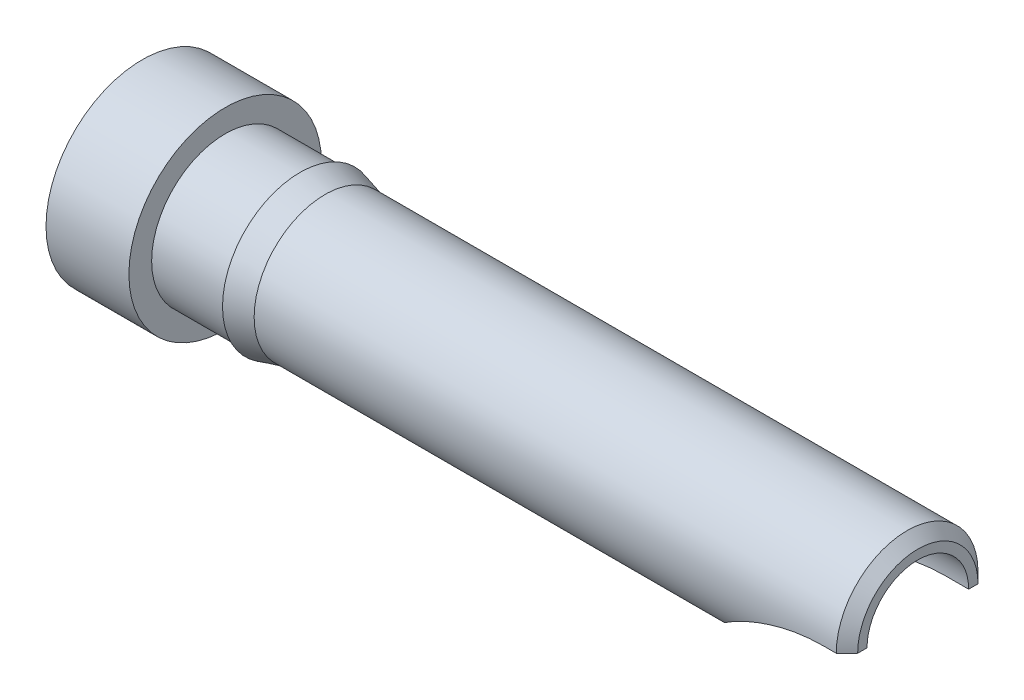
ISO-10303-21;
HEADER;
FILE_DESCRIPTION(('STEP AP214'),'2;1');
FILE_NAME('part.step','',(''),(''),'','','');
FILE_SCHEMA(('AUTOMOTIVE_DESIGN { 1 0 10303 214 1 1 1 1 }'));
ENDSEC;
DATA;
#1=APPLICATION_CONTEXT('core data for automotive mechanical design processes');
#2=APPLICATION_PROTOCOL_DEFINITION('international standard','automotive_design',2000,#1);
#3=PRODUCT_CONTEXT('',#1,'mechanical');
#4=PRODUCT('Part','Part','',(#3));
#5=PRODUCT_RELATED_PRODUCT_CATEGORY('part','',(#4));
#6=PRODUCT_DEFINITION_FORMATION('','',#4);
#7=PRODUCT_DEFINITION_CONTEXT('part definition',#1,'design');
#8=PRODUCT_DEFINITION('design','',#6,#7);
#9=PRODUCT_DEFINITION_SHAPE('','',#8);
#10=(LENGTH_UNIT() NAMED_UNIT(*) SI_UNIT(.MILLI.,.METRE.));
#11=(NAMED_UNIT(*) PLANE_ANGLE_UNIT() SI_UNIT($,.RADIAN.));
#12=(NAMED_UNIT(*) SI_UNIT($,.STERADIAN.) SOLID_ANGLE_UNIT());
#13=UNCERTAINTY_MEASURE_WITH_UNIT(LENGTH_MEASURE(1.E-05),#10,'distance_accuracy_value','');
#14=(GEOMETRIC_REPRESENTATION_CONTEXT(3) GLOBAL_UNCERTAINTY_ASSIGNED_CONTEXT((#13)) GLOBAL_UNIT_ASSIGNED_CONTEXT((#10,
#11,#12)) REPRESENTATION_CONTEXT('',''));
#15=CARTESIAN_POINT('',(0.,0.,0.));
#16=DIRECTION('',(0.,0.,1.));
#17=DIRECTION('',(1.,0.,0.));
#18=AXIS2_PLACEMENT_3D('',#15,#16,#17);
#19=CARTESIAN_POINT('',(0.,0.,0.));
#20=DIRECTION('',(-1.,0.,0.));
#21=DIRECTION('',(0.,0.,1.));
#22=AXIS2_PLACEMENT_3D('',#19,#20,#21);
#23=CYLINDRICAL_SURFACE('',#22,0.673099999999982);
#24=CARTESIAN_POINT('',(1.73558522628081,0.,0.));
#25=DIRECTION('',(-1.,0.,0.));
#26=DIRECTION('',(0.,0.,1.));
#27=AXIS2_PLACEMENT_3D('',#24,#25,#26);
#28=CIRCLE('',#27,0.673099999999982);
#29=CARTESIAN_POINT('',(1.73558522628081,0.,0.673099999999982));
#30=VERTEX_POINT('',#29);
#31=EDGE_CURVE('E134',#30,#30,#28,.T.);
#32=ORIENTED_EDGE('',*,*,#31,.F.);
#33=EDGE_LOOP('',(#32));
#34=FACE_BOUND('',#33,.T.);
#35=DIRECTION('',(-1.,0.,0.));
#36=VECTOR('',#35,1.);
#37=CARTESIAN_POINT('',(7.366,0.,0.6731));
#38=LINE('',#37,#36);
#39=CARTESIAN_POINT('',(7.26439999999999,0.,0.6731));
#40=VERTEX_POINT('',#39);
#41=CARTESIAN_POINT('',(7.14627206901013,0.,0.6731));
#42=VERTEX_POINT('',#41);
#43=EDGE_CURVE('E96',#40,#42,#38,.T.);
#44=ORIENTED_EDGE('',*,*,#43,.F.);
#45=CARTESIAN_POINT('',(7.2644,0.,0.));
#46=DIRECTION('',(-1.,0.,0.));
#47=DIRECTION('',(0.,0.,1.));
#48=AXIS2_PLACEMENT_3D('',#45,#46,#47);
#49=CIRCLE('',#48,0.673099999999982);
#50=CARTESIAN_POINT('',(7.26439999999999,0.,-0.6731));
#51=VERTEX_POINT('',#50);
#52=EDGE_CURVE('E100',#40,#51,#49,.T.);
#53=ORIENTED_EDGE('',*,*,#52,.T.);
#54=DIRECTION('',(-1.,0.,0.));
#55=VECTOR('',#54,1.);
#56=CARTESIAN_POINT('',(7.366,0.,-0.6731));
#57=LINE('',#56,#55);
#58=CARTESIAN_POINT('',(7.14627206901013,0.,-0.6731));
#59=VERTEX_POINT('',#58);
#60=EDGE_CURVE('E93',#51,#59,#57,.T.);
#61=ORIENTED_EDGE('',*,*,#60,.T.);
#62=CARTESIAN_POINT('',(7.14627206901013,0.,0.673099999999982));
#63=CARTESIAN_POINT('',(7.10153435985772,4.46470911448281E-06,0.673066996941822));
#64=CARTESIAN_POINT('',(7.05679798581207,-0.00187603562394162,0.673099064908512));
#65=CARTESIAN_POINT('',(6.96761605547631,-0.00937573830040865,0.67305391674016));
#66=CARTESIAN_POINT('',(6.92317066463661,-0.0149969078173788,0.672976643079558));
#67=CARTESIAN_POINT('',(6.83458204846246,-0.0300016269015608,0.672471063789258));
#68=CARTESIAN_POINT('',(6.7904434489281,-0.0394125410488758,0.67204018084596));
#69=CARTESIAN_POINT('',(6.70315420933484,-0.0619158750425256,0.670340910004236));
#70=CARTESIAN_POINT('',(6.66000318996158,-0.075006854870609,0.669072849434154));
#71=CARTESIAN_POINT('',(6.55388062167852,-0.112164126167215,0.664074429507753));
#72=CARTESIAN_POINT('',(6.49170662000296,-0.138452468771553,0.659434069353343));
#73=CARTESIAN_POINT('',(6.37191822498993,-0.198252354734136,0.643978500323973));
#74=CARTESIAN_POINT('',(6.31428673040485,-0.23173484508686,0.633187847450312));
#75=CARTESIAN_POINT('',(6.22258929627688,-0.292734721011279,0.606709296231323));
#76=CARTESIAN_POINT('',(6.18681894934434,-0.318808508889903,0.593634968973889));
#77=CARTESIAN_POINT('',(6.11917052511126,-0.372376322965744,0.561578420711508));
#78=CARTESIAN_POINT('',(6.08728729240408,-0.399868397657579,0.542604146013661));
#79=CARTESIAN_POINT('',(6.03409132474372,-0.44922187221879,0.502071484334222));
#80=CARTESIAN_POINT('',(6.01192587564313,-0.471146591222787,0.481717307907256));
#81=CARTESIAN_POINT('',(5.97128248307482,-0.513507841378227,0.436275116431738));
#82=CARTESIAN_POINT('',(5.95280350946342,-0.533944787254325,0.41118842765306));
#83=CARTESIAN_POINT('',(5.91982554956495,-0.572040917007239,0.356307564587144));
#84=CARTESIAN_POINT('',(5.90535496183745,-0.589679920238312,0.326482044476282));
#85=CARTESIAN_POINT('',(5.88080325132035,-0.62059703023007,0.262995813801498));
#86=CARTESIAN_POINT('',(5.87072012677458,-0.633877125038099,0.229336861083235));
#87=CARTESIAN_POINT('',(5.85595423624755,-0.653704306568095,0.163610127165051));
#88=CARTESIAN_POINT('',(5.85076652044479,-0.660870623123024,0.131840701116766));
#89=CARTESIAN_POINT('',(5.84381783450025,-0.670528273084018,0.0672357167353866));
#90=CARTESIAN_POINT('',(5.84205568323101,-0.67302121784828,0.0344005298459773));
#91=CARTESIAN_POINT('',(5.8419498312962,-0.673171000090173,-0.0295028732713886));
#92=CARTESIAN_POINT('',(5.84342654509382,-0.671081898503721,-0.0605706881083138));
#93=CARTESIAN_POINT('',(5.84944189038786,-0.662704482073932,-0.121825395034786));
#94=CARTESIAN_POINT('',(5.85397997274739,-0.656416920336778,-0.152012444099867));
#95=CARTESIAN_POINT('',(5.86611211447296,-0.640026511809589,-0.210601498801503));
#96=CARTESIAN_POINT('',(5.87369883341493,-0.629932832856258,-0.23900760397343));
#97=CARTESIAN_POINT('',(5.89190305399311,-0.606511203684345,-0.293402561812445));
#98=CARTESIAN_POINT('',(5.90252064366179,-0.593183159524428,-0.319391344238661));
#99=CARTESIAN_POINT('',(5.92716311816597,-0.563475343359758,-0.369373318030377));
#100=CARTESIAN_POINT('',(5.94130352602772,-0.54699777269607,-0.393251033632782));
#101=CARTESIAN_POINT('',(5.97254920219838,-0.512283982215925,-0.437517649837415));
#102=CARTESIAN_POINT('',(5.98965574717114,-0.494047006634338,-0.457905040618374));
#103=CARTESIAN_POINT('',(6.03305703349425,-0.450137924421539,-0.501706887645628));
#104=CARTESIAN_POINT('',(6.06046647929303,-0.424108231610728,-0.523660905420559));
#105=CARTESIAN_POINT('',(6.11934854163021,-0.37235003239704,-0.561654113279127));
#106=CARTESIAN_POINT('',(6.15082789046543,-0.346622103842159,-0.577683329325189));
#107=CARTESIAN_POINT('',(6.23032271379205,-0.286794572141143,-0.610243425678054));
#108=CARTESIAN_POINT('',(6.27989964764994,-0.253485711935731,-0.624387179060117));
#109=CARTESIAN_POINT('',(6.38361083729961,-0.192134868798973,-0.645918596445292));
#110=CARTESIAN_POINT('',(6.43775691585452,-0.164107196213927,-0.65328810790118));
#111=CARTESIAN_POINT('',(6.53229732354482,-0.121860077027676,-0.662211767996978));
#112=CARTESIAN_POINT('',(6.57189158985068,-0.106029222479572,-0.66485108233521));
#113=CARTESIAN_POINT('',(6.65229729696788,-0.0775550362771958,-0.66877227564151));
#114=CARTESIAN_POINT('',(6.69310929581059,-0.0649131918895133,-0.670053522132692));
#115=CARTESIAN_POINT('',(6.77558144884244,-0.0429432358586147,-0.671818838287846));
#116=CARTESIAN_POINT('',(6.81724068495996,-0.0336117203416867,-0.672303728685368));
#117=CARTESIAN_POINT('',(6.90115412649108,-0.0183104391839074,-0.672894594671953));
#118=CARTESIAN_POINT('',(6.94340799060913,-0.012338819765698,-0.673000779379779));
#119=CARTESIAN_POINT('',(7.01250550612327,-0.00537525277684272,-0.6730837168539));
#120=CARTESIAN_POINT('',(7.03925004323426,-0.00335777151107894,-0.673093874895806));
#121=CARTESIAN_POINT('',(7.09275291792986,-0.000671365620898936,-0.673100097370282));
#122=CARTESIAN_POINT('',(7.11951111996911,2.58752109543171E-07,-0.673096190061669));
#123=CARTESIAN_POINT('',(7.14627206901013,0.,-0.673099999999982));
#124=B_SPLINE_CURVE_WITH_KNOTS('',3,(#62,#63,#64,#65,#66,#67,#68,#69,#70,#71,#72,#73,#74,#75,
#76,#77,#78,#79,#80,#81,#82,#83,#84,#85,#86,#87,#88,#89,#90,#91,#92,#93,#94,#95,#96,#97,#98,#99,
#100,#101,#102,#103,#104,#105,#106,#107,#108,#109,#110,#111,#112,#113,#114,#115,#116,#117,#118,
#119,#120,#121,#122,#123),.UNSPECIFIED.,.F.,.F.,(4,2,2,2,2,2,2,2,2,2,2,2,2,2,2,2,2,2,2,2,2,2,2,
2,2,2,2,2,2,2,4),(0.,0.134171278306699,0.268413171516379,0.403642280975282,0.538818548450334,
0.741116789579524,0.942612925543703,1.08063370876182,1.21846939890387,1.329720832662,
1.44094113479115,1.55293035026713,1.66486841756249,1.7632947132309,1.8616870656958,
1.95476234070997,2.04782092466619,2.14065677455989,2.2334953211706,2.32991102311003,
2.42636832709929,2.55677763328148,2.68740548625478,2.8705289698726,3.05414174056488,
3.1821608506811,3.31023955546375,3.43818617786956,3.56606213805326,3.64649259518548,
3.72676154907161),.UNSPECIFIED.);
#125=EDGE_CURVE('E80',#42,#59,#124,.T.);
#126=ORIENTED_EDGE('',*,*,#125,.F.);
#127=EDGE_LOOP('',(#44,#53,#61,#126));
#128=FACE_BOUND('',#127,.T.);
#129=ADVANCED_FACE('F34',(#34,#128),#23,.T.);
#130=CARTESIAN_POINT('',(7.366,0.,0.));
#131=DIRECTION('',(-1.,0.,0.));
#132=DIRECTION('',(0.,0.,1.));
#133=AXIS2_PLACEMENT_3D('',#130,#131,#132);
#134=PLANE('',#133);
#135=DIRECTION('',(0.,0.,-1.));
#136=VECTOR('',#135,1.);
#137=CARTESIAN_POINT('',(7.366,0.,0.6731));
#138=LINE('',#137,#136);
#139=CARTESIAN_POINT('',(7.366,0.,-0.4826));
#140=VERTEX_POINT('',#139);
#141=CARTESIAN_POINT('',(7.366,0.,-0.571499999999974));
#142=VERTEX_POINT('',#141);
#143=EDGE_CURVE('E104',#140,#142,#138,.T.);
#144=ORIENTED_EDGE('',*,*,#143,.T.);
#145=CARTESIAN_POINT('',(7.366,0.,0.));
#146=DIRECTION('',(-1.,0.,0.));
#147=DIRECTION('',(0.,0.,1.));
#148=AXIS2_PLACEMENT_3D('',#145,#146,#147);
#149=CIRCLE('',#148,0.571499999999975);
#150=CARTESIAN_POINT('',(7.366,0.,0.571499999999974));
#151=VERTEX_POINT('',#150);
#152=EDGE_CURVE('E152',#151,#142,#149,.T.);
#153=ORIENTED_EDGE('',*,*,#152,.F.);
#154=CARTESIAN_POINT('',(7.366,0.,0.4826));
#155=VERTEX_POINT('',#154);
#156=EDGE_CURVE('E107',#151,#155,#138,.T.);
#157=ORIENTED_EDGE('',*,*,#156,.T.);
#158=CARTESIAN_POINT('',(7.366,0.,0.));
#159=DIRECTION('',(1.,0.,0.));
#160=DIRECTION('',(0.,0.,-1.));
#161=AXIS2_PLACEMENT_3D('',#158,#159,#160);
#162=CIRCLE('',#161,0.4826);
#163=EDGE_CURVE('E88',#140,#155,#162,.T.);
#164=ORIENTED_EDGE('',*,*,#163,.F.);
#165=EDGE_LOOP('',(#144,#153,#157,#164));
#166=FACE_BOUND('',#165,.T.);
#167=ADVANCED_FACE('F165',(#166),#134,.F.);
#168=CARTESIAN_POINT('',(7.366,0.,0.));
#169=DIRECTION('',(-1.,0.,0.));
#170=DIRECTION('',(0.,0.,1.));
#171=AXIS2_PLACEMENT_3D('',#168,#169,#170);
#172=CONICAL_SURFACE('',#171,0.571499999999975,0.785398163397516);
#173=DIRECTION('',(-0.7071067811865,0.,0.707106781186595));
#174=VECTOR('',#173,1.);
#175=CARTESIAN_POINT('',(7.93749999999989,0.,0.));
#176=LINE('',#175,#174);
#177=EDGE_CURVE('E89',#151,#40,#176,.T.);
#178=ORIENTED_EDGE('',*,*,#177,.F.);
#179=ORIENTED_EDGE('',*,*,#152,.T.);
#180=DIRECTION('',(0.7071067811865,0.,0.707106781186595));
#181=VECTOR('',#180,1.);
#182=CARTESIAN_POINT('',(7.93749999999989,0.,0.));
#183=LINE('',#182,#181);
#184=EDGE_CURVE('E108',#51,#142,#183,.T.);
#185=ORIENTED_EDGE('',*,*,#184,.F.);
#186=ORIENTED_EDGE('',*,*,#52,.F.);
#187=EDGE_LOOP('',(#178,#179,#185,#186));
#188=FACE_BOUND('',#187,.T.);
#189=ADVANCED_FACE('F169',(#188),#172,.T.);
#190=CARTESIAN_POINT('',(7.366,0.,0.));
#191=DIRECTION('',(1.,0.,0.));
#192=DIRECTION('',(0.,0.,-1.));
#193=AXIS2_PLACEMENT_3D('',#190,#191,#192);
#194=CYLINDRICAL_SURFACE('',#193,0.4826);
#195=CARTESIAN_POINT('',(5.08,0.,0.));
#196=DIRECTION('',(1.,0.,0.));
#197=DIRECTION('',(0.,0.,-1.));
#198=AXIS2_PLACEMENT_3D('',#195,#196,#197);
#199=CIRCLE('',#198,0.4826);
#200=CARTESIAN_POINT('',(5.08,0.,-0.4826));
#201=VERTEX_POINT('',#200);
#202=EDGE_CURVE('E155',#201,#201,#199,.T.);
#203=ORIENTED_EDGE('',*,*,#202,.F.);
#204=EDGE_LOOP('',(#203));
#205=FACE_BOUND('',#204,.T.);
#206=DIRECTION('',(1.,0.,0.));
#207=VECTOR('',#206,1.);
#208=CARTESIAN_POINT('',(7.366,0.,-0.4826));
#209=LINE('',#208,#207);
#210=CARTESIAN_POINT('',(7.14627206901013,0.,-0.4826));
#211=VERTEX_POINT('',#210);
#212=EDGE_CURVE('E11',#140,#211,#209,.F.);
#213=ORIENTED_EDGE('',*,*,#212,.F.);
#214=ORIENTED_EDGE('',*,*,#163,.T.);
#215=DIRECTION('',(1.,0.,0.));
#216=VECTOR('',#215,1.);
#217=CARTESIAN_POINT('',(7.366,0.,0.4826));
#218=LINE('',#217,#216);
#219=CARTESIAN_POINT('',(7.14627206901013,0.,0.4826));
#220=VERTEX_POINT('',#219);
#221=EDGE_CURVE('E132',#220,#155,#218,.T.);
#222=ORIENTED_EDGE('',*,*,#221,.F.);
#223=CARTESIAN_POINT('',(7.14627206901013,0.,-0.4826));
#224=CARTESIAN_POINT('',(7.10559636320607,3.11156468287568E-06,-0.482568413246393));
#225=CARTESIAN_POINT('',(7.0649213791167,-0.00155082774002899,-0.482599067192687));
#226=CARTESIAN_POINT('',(6.98378324906303,-0.00775179817454373,-0.482556107346207));
#227=CARTESIAN_POINT('',(6.94332024582744,-0.0124006962494511,-0.482482430588676));
#228=CARTESIAN_POINT('',(6.86253133758448,-0.0248220024737073,-0.48199954437275));
#229=CARTESIAN_POINT('',(6.82220937681218,-0.032620086309062,-0.481587547296954));
#230=CARTESIAN_POINT('',(6.74231726910404,-0.0512833724740965,-0.47995873339339));
#231=CARTESIAN_POINT('',(6.70274681136048,-0.0621472759948752,-0.478742257083983));
#232=CARTESIAN_POINT('',(6.60885503590182,-0.0918476218901493,-0.474108354456359));
#233=CARTESIAN_POINT('',(6.55501360149026,-0.112132698438881,-0.470001662878306));
#234=CARTESIAN_POINT('',(6.45046429423993,-0.158076039761597,-0.456604116046307));
#235=CARTESIAN_POINT('',(6.39974542685928,-0.183713868138482,-0.44733276074436));
#236=CARTESIAN_POINT('',(6.32008663489397,-0.229300894596023,-0.425107802627955));
#237=CARTESIAN_POINT('',(6.28978751853437,-0.248055743012043,-0.414615694455189));
#238=CARTESIAN_POINT('',(6.23185028468074,-0.286551515944586,-0.389004937024612));
#239=CARTESIAN_POINT('',(6.20420869247025,-0.306291100146206,-0.37389244011767));
#240=CARTESIAN_POINT('',(6.15919457304848,-0.340475994326644,-0.342592044045321));
#241=CARTESIAN_POINT('',(6.14100211962167,-0.35498617004071,-0.327664018595269));
#242=CARTESIAN_POINT('',(6.10720110260123,-0.383051065015137,-0.294358557105889));
#243=CARTESIAN_POINT('',(6.09158919557516,-0.396607007317103,-0.275985651323811));
#244=CARTESIAN_POINT('',(6.06622152501292,-0.419367436755214,-0.239588818049615));
#245=CARTESIAN_POINT('',(6.0559166747234,-0.428909430951289,-0.222161015014629));
#246=CARTESIAN_POINT('',(6.0377297200039,-0.446106971668984,-0.185217599844196));
#247=CARTESIAN_POINT('',(6.02984672882881,-0.4537632084421,-0.165702755399516));
#248=CARTESIAN_POINT('',(6.01675682036067,-0.466656298694377,-0.124881111826358));
#249=CARTESIAN_POINT('',(6.01156689420551,-0.471877770257115,-0.103563898859299));
#250=CARTESIAN_POINT('',(6.00415808634382,-0.479376904107875,-0.0599157188757849));
#251=CARTESIAN_POINT('',(6.00193782665225,-0.481655931732079,-0.0375852270181031));
#252=CARTESIAN_POINT('',(6.00063490546902,-0.48299111268796,0.00483130566893383));
#253=CARTESIAN_POINT('',(6.00123870872289,-0.482369341235943,0.0248987284731675));
#254=CARTESIAN_POINT('',(6.00485780591351,-0.478674182618346,0.0645796788795449));
#255=CARTESIAN_POINT('',(6.00787253974846,-0.475601364874581,0.0841933108165069));
#256=CARTESIAN_POINT('',(6.01612138887356,-0.467313275479802,0.122018161864448));
#257=CARTESIAN_POINT('',(6.02130770469646,-0.462144217784248,0.140250148162507));
#258=CARTESIAN_POINT('',(6.03372923470304,-0.449998432792089,0.175355341604345));
#259=CARTESIAN_POINT('',(6.04096479287101,-0.443021402027228,0.192228320014836));
#260=CARTESIAN_POINT('',(6.05796056316649,-0.42701434974986,0.225684386610983));
#261=CARTESIAN_POINT('',(6.06788052088783,-0.417861964298873,0.242127070658866));
#262=CARTESIAN_POINT('',(6.08959903799094,-0.398411486176996,0.272954180100983));
#263=CARTESIAN_POINT('',(6.10139870909161,-0.388112716592832,0.287337377834142));
#264=CARTESIAN_POINT('',(6.13332278426048,-0.361165236677973,0.321166086601313));
#265=CARTESIAN_POINT('',(6.1545325719473,-0.344057277009357,0.339224807623148));
#266=CARTESIAN_POINT('',(6.19981858965855,-0.309586319605807,0.370959040401207));
#267=CARTESIAN_POINT('',(6.22390114666855,-0.292222835617257,0.384624622897615));
#268=CARTESIAN_POINT('',(6.2875462205532,-0.249135294908827,0.41454096737419));
#269=CARTESIAN_POINT('',(6.32855299505503,-0.223852867993193,0.428328745738787));
#270=CARTESIAN_POINT('',(6.41391398883157,-0.176579079086453,0.449888369759487));
#271=CARTESIAN_POINT('',(6.45827750779956,-0.154597404157936,0.457642776776627));
#272=CARTESIAN_POINT('',(6.54032848970227,-0.118623438166407,0.468088976302742));
#273=CARTESIAN_POINT('',(6.57762104828912,-0.103909625792596,0.471474985934354));
#274=CARTESIAN_POINT('',(6.65332776888436,-0.0772892322379143,0.476564050516));
#275=CARTESIAN_POINT('',(6.69174266021337,-0.0653845242303601,0.478265984888705));
#276=CARTESIAN_POINT('',(6.7693705272144,-0.0445005128298764,0.48065857974409));
#277=CARTESIAN_POINT('',(6.80858323852675,-0.0355202566601652,0.481349569845846));
#278=CARTESIAN_POINT('',(6.88755822956028,-0.0205413366218222,0.482220945376052));
#279=CARTESIAN_POINT('',(6.92732019919921,-0.0145410558705825,0.48240160794931));
#280=CARTESIAN_POINT('',(6.99699975086234,-0.00669618717794625,0.482565344431033));
#281=CARTESIAN_POINT('',(7.0268437380328,-0.00418223494122,0.482587039596651));
#282=CARTESIAN_POINT('',(7.08654859337287,-0.000835973527503762,0.48259992095909));
#283=CARTESIAN_POINT('',(7.11640921932852,6.57627545181277E-07,0.482591185725966));
#284=CARTESIAN_POINT('',(7.14627206901013,0.,0.4826));
#285=B_SPLINE_CURVE_WITH_KNOTS('',3,(#223,#224,#225,#226,#227,#228,#229,#230,#231,#232,#233,
#234,#235,#236,#237,#238,#239,#240,#241,#242,#243,#244,#245,#246,#247,#248,#249,#250,#251,#252,
#253,#254,#255,#256,#257,#258,#259,#260,#261,#262,#263,#264,#265,#266,#267,#268,#269,#270,#271,
#272,#273,#274,#275,#276,#277,#278,#279,#280,#281,#282,#283,#284),.UNSPECIFIED.,.F.,.F.,(4,2,2,
2,2,2,2,2,2,2,2,2,2,2,2,2,2,2,2,2,2,2,2,2,2,2,2,2,2,2,4),(0.,0.121996179691924,
0.244066016840592,0.367151871365472,0.490185659673897,0.662786855266494,0.834740743821611,
0.94588792646613,1.05688774921493,1.13954527944655,1.22209486213678,1.28897037722341,
1.35582137709191,1.42308917762401,1.49032575370084,1.55028631393479,1.61023294831574,
1.66892420540318,1.72762532020564,1.7912006270573,1.85481367481123,1.95232563005499,
2.05005645461195,2.19953914932629,2.34945231475233,2.4699945032072,2.59061684615185,
2.71119985132686,2.83171735859529,2.92152148958258,3.01109392199202),.UNSPECIFIED.);
#286=EDGE_CURVE('E42',#211,#220,#285,.T.);
#287=ORIENTED_EDGE('',*,*,#286,.F.);
#288=EDGE_LOOP('',(#213,#214,#222,#287));
#289=FACE_BOUND('',#288,.T.);
#290=ADVANCED_FACE('F123',(#205,#289),#194,.F.);
#291=CARTESIAN_POINT('',(1.73558522628081,0.,0.));
#292=DIRECTION('',(-1.,0.,0.));
#293=DIRECTION('',(0.,0.,1.));
#294=AXIS2_PLACEMENT_3D('',#291,#292,#293);
#295=CONICAL_SURFACE('',#294,0.673099999999982,0.261799387799027);
#296=CARTESIAN_POINT('',(1.4986,0.,0.));
#297=DIRECTION('',(-1.,0.,0.));
#298=DIRECTION('',(0.,0.,1.));
#299=AXIS2_PLACEMENT_3D('',#296,#297,#298);
#300=CIRCLE('',#299,0.7366);
#301=CARTESIAN_POINT('',(1.4986,0.,0.7366));
#302=VERTEX_POINT('',#301);
#303=EDGE_CURVE('E137',#302,#302,#300,.T.);
#304=ORIENTED_EDGE('',*,*,#303,.F.);
#305=EDGE_LOOP('',(#304));
#306=FACE_BOUND('',#305,.T.);
#307=ORIENTED_EDGE('',*,*,#31,.T.);
#308=EDGE_LOOP('',(#307));
#309=FACE_BOUND('',#308,.T.);
#310=ADVANCED_FACE('F176',(#306,#309),#295,.T.);
#311=CARTESIAN_POINT('',(1.4986,0.6985,0.));
#312=DIRECTION('',(1.,0.,0.));
#313=DIRECTION('',(0.,0.,-1.));
#314=AXIS2_PLACEMENT_3D('',#311,#312,#313);
#315=PLANE('',#314);
#316=CARTESIAN_POINT('',(1.4986,0.,0.));
#317=DIRECTION('',(-1.,0.,0.));
#318=DIRECTION('',(0.,0.,1.));
#319=AXIS2_PLACEMENT_3D('',#316,#317,#318);
#320=CIRCLE('',#319,0.6985);
#321=CARTESIAN_POINT('',(1.4986,0.,0.6985));
#322=VERTEX_POINT('',#321);
#323=EDGE_CURVE('E140',#322,#322,#320,.T.);
#324=ORIENTED_EDGE('',*,*,#323,.F.);
#325=EDGE_LOOP('',(#324));
#326=FACE_BOUND('',#325,.T.);
#327=ORIENTED_EDGE('',*,*,#303,.T.);
#328=EDGE_LOOP('',(#327));
#329=FACE_BOUND('',#328,.T.);
#330=ADVANCED_FACE('F186',(#326,#329),#315,.F.);
#331=CARTESIAN_POINT('',(0.,0.,0.));
#332=DIRECTION('',(-1.,0.,0.));
#333=DIRECTION('',(0.,0.,1.));
#334=AXIS2_PLACEMENT_3D('',#331,#332,#333);
#335=CYLINDRICAL_SURFACE('',#334,0.6985);
#336=CARTESIAN_POINT('',(0.7874,0.,0.));
#337=DIRECTION('',(-1.,0.,0.));
#338=DIRECTION('',(0.,0.,1.));
#339=AXIS2_PLACEMENT_3D('',#336,#337,#338);
#340=CIRCLE('',#339,0.6985);
#341=CARTESIAN_POINT('',(0.7874,0.,0.6985));
#342=VERTEX_POINT('',#341);
#343=EDGE_CURVE('E143',#342,#342,#340,.T.);
#344=ORIENTED_EDGE('',*,*,#343,.F.);
#345=EDGE_LOOP('',(#344));
#346=FACE_BOUND('',#345,.T.);
#347=ORIENTED_EDGE('',*,*,#323,.T.);
#348=EDGE_LOOP('',(#347));
#349=FACE_BOUND('',#348,.T.);
#350=ADVANCED_FACE('F191',(#346,#349),#335,.T.);
#351=CARTESIAN_POINT('',(0.7874,0.9144,0.));
#352=DIRECTION('',(-1.,0.,0.));
#353=DIRECTION('',(0.,0.,1.));
#354=AXIS2_PLACEMENT_3D('',#351,#352,#353);
#355=PLANE('',#354);
#356=CARTESIAN_POINT('',(0.7874,0.,0.));
#357=DIRECTION('',(-1.,0.,0.));
#358=DIRECTION('',(0.,0.,1.));
#359=AXIS2_PLACEMENT_3D('',#356,#357,#358);
#360=CIRCLE('',#359,0.9144);
#361=CARTESIAN_POINT('',(0.7874,0.,0.9144));
#362=VERTEX_POINT('',#361);
#363=EDGE_CURVE('E146',#362,#362,#360,.T.);
#364=ORIENTED_EDGE('',*,*,#363,.F.);
#365=EDGE_LOOP('',(#364));
#366=FACE_BOUND('',#365,.T.);
#367=ORIENTED_EDGE('',*,*,#343,.T.);
#368=EDGE_LOOP('',(#367));
#369=FACE_BOUND('',#368,.T.);
#370=ADVANCED_FACE('F198',(#366,#369),#355,.F.);
#371=CARTESIAN_POINT('',(0.,0.,0.));
#372=DIRECTION('',(-1.,0.,0.));
#373=DIRECTION('',(0.,0.,1.));
#374=AXIS2_PLACEMENT_3D('',#371,#372,#373);
#375=CYLINDRICAL_SURFACE('',#374,0.914400000000005);
#376=CARTESIAN_POINT('',(0.,0.,0.));
#377=DIRECTION('',(-1.,0.,0.));
#378=DIRECTION('',(0.,0.,1.));
#379=AXIS2_PLACEMENT_3D('',#376,#377,#378);
#380=CIRCLE('',#379,0.91440000000001);
#381=CARTESIAN_POINT('',(0.,0.,0.91440000000001));
#382=VERTEX_POINT('',#381);
#383=EDGE_CURVE('E149',#382,#382,#380,.T.);
#384=ORIENTED_EDGE('',*,*,#383,.F.);
#385=EDGE_LOOP('',(#384));
#386=FACE_BOUND('',#385,.T.);
#387=ORIENTED_EDGE('',*,*,#363,.T.);
#388=EDGE_LOOP('',(#387));
#389=FACE_BOUND('',#388,.T.);
#390=ADVANCED_FACE('F202',(#386,#389),#375,.T.);
#391=CARTESIAN_POINT('',(0.,0.,0.));
#392=DIRECTION('',(1.,0.,0.));
#393=DIRECTION('',(0.,0.,-1.));
#394=AXIS2_PLACEMENT_3D('',#391,#392,#393);
#395=PLANE('',#394);
#396=ORIENTED_EDGE('',*,*,#383,.T.);
#397=EDGE_LOOP('',(#396));
#398=FACE_BOUND('',#397,.T.);
#399=ADVANCED_FACE('F206',(#398),#395,.F.);
#400=CARTESIAN_POINT('',(5.08,0.,0.));
#401=DIRECTION('',(1.,0.,0.));
#402=DIRECTION('',(0.,0.,-1.));
#403=AXIS2_PLACEMENT_3D('',#400,#401,#402);
#404=CONICAL_SURFACE('',#403,0.4826,1.02974425867666);
#405=CARTESIAN_POINT('',(4.7900246652573,0.,0.));
#406=VERTEX_POINT('',#405);
#407=VERTEX_LOOP('',#406);
#408=FACE_BOUND('',#407,.T.);
#409=ORIENTED_EDGE('',*,*,#202,.T.);
#410=EDGE_LOOP('',(#409));
#411=FACE_BOUND('',#410,.T.);
#412=ADVANCED_FACE('F122',(#408,#411),#404,.F.);
#413=CARTESIAN_POINT('',(7.14627206901013,-1.6002,0.6731));
#414=DIRECTION('',(0.,0.,-1.));
#415=DIRECTION('',(-1.,0.,0.));
#416=AXIS2_PLACEMENT_3D('',#413,#414,#415);
#417=CYLINDRICAL_SURFACE('',#416,1.6002);
#418=ORIENTED_EDGE('',*,*,#125,.T.);
#419=DIRECTION('',(0.,0.,-1.));
#420=VECTOR('',#419,1.);
#421=CARTESIAN_POINT('',(7.14627206901013,0.,0.6731));
#422=LINE('',#421,#420);
#423=EDGE_CURVE('E83',#211,#59,#422,.T.);
#424=ORIENTED_EDGE('',*,*,#423,.F.);
#425=ORIENTED_EDGE('',*,*,#286,.T.);
#426=EDGE_CURVE('E49',#42,#220,#422,.T.);
#427=ORIENTED_EDGE('',*,*,#426,.F.);
#428=EDGE_LOOP('',(#418,#424,#425,#427));
#429=FACE_BOUND('',#428,.T.);
#430=ADVANCED_FACE('F82',(#429),#417,.F.);
#431=CARTESIAN_POINT('',(7.366,0.,0.6731));
#432=DIRECTION('',(0.,-1.,0.));
#433=DIRECTION('',(0.,0.,-1.));
#434=AXIS2_PLACEMENT_3D('',#431,#432,#433);
#435=PLANE('',#434);
#436=ORIENTED_EDGE('',*,*,#177,.T.);
#437=ORIENTED_EDGE('',*,*,#43,.T.);
#438=ORIENTED_EDGE('',*,*,#426,.T.);
#439=ORIENTED_EDGE('',*,*,#221,.T.);
#440=ORIENTED_EDGE('',*,*,#156,.F.);
#441=EDGE_LOOP('',(#436,#437,#438,#439,#440));
#442=FACE_BOUND('',#441,.T.);
#443=ADVANCED_FACE('F121',(#442),#435,.T.);
#444=ORIENTED_EDGE('',*,*,#184,.T.);
#445=ORIENTED_EDGE('',*,*,#143,.F.);
#446=ORIENTED_EDGE('',*,*,#212,.T.);
#447=ORIENTED_EDGE('',*,*,#423,.T.);
#448=ORIENTED_EDGE('',*,*,#60,.F.);
#449=EDGE_LOOP('',(#444,#445,#446,#447,#448));
#450=FACE_BOUND('',#449,.T.);
#451=ADVANCED_FACE('F92',(#450),#435,.T.);
#452=CLOSED_SHELL('',(#129,#167,#189,#290,#310,#330,#350,#370,#390,#399,#412,#430,#443,#451));
#453=MANIFOLD_SOLID_BREP('B2',#452);
#454=ADVANCED_BREP_SHAPE_REPRESENTATION('',(#18,#453),#14);
#455=SHAPE_DEFINITION_REPRESENTATION(#9,#454);
ENDSEC;
END-ISO-10303-21;
